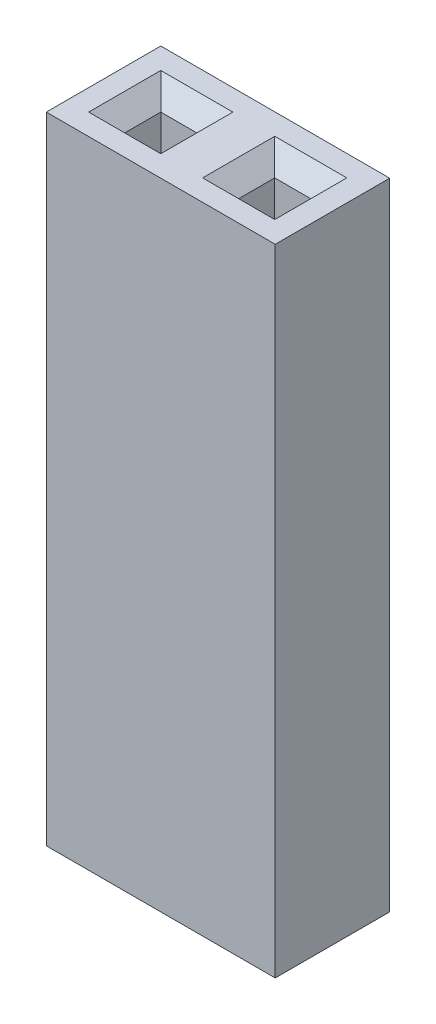
ISO-10303-21;
HEADER;
FILE_DESCRIPTION(('STEP AP214'),'2;1');
FILE_NAME('part.step','',(''),(''),'','','');
FILE_SCHEMA(('AUTOMOTIVE_DESIGN { 1 0 10303 214 1 1 1 1 }'));
ENDSEC;
DATA;
#1=APPLICATION_CONTEXT('core data for automotive mechanical design processes');
#2=APPLICATION_PROTOCOL_DEFINITION('international standard','automotive_design',2000,#1);
#3=PRODUCT_CONTEXT('',#1,'mechanical');
#4=PRODUCT('Part','Part','',(#3));
#5=PRODUCT_RELATED_PRODUCT_CATEGORY('part','',(#4));
#6=PRODUCT_DEFINITION_FORMATION('','',#4);
#7=PRODUCT_DEFINITION_CONTEXT('part definition',#1,'design');
#8=PRODUCT_DEFINITION('design','',#6,#7);
#9=PRODUCT_DEFINITION_SHAPE('','',#8);
#10=(LENGTH_UNIT() NAMED_UNIT(*) SI_UNIT(.MILLI.,.METRE.));
#11=(NAMED_UNIT(*) PLANE_ANGLE_UNIT() SI_UNIT($,.RADIAN.));
#12=(NAMED_UNIT(*) SI_UNIT($,.STERADIAN.) SOLID_ANGLE_UNIT());
#13=UNCERTAINTY_MEASURE_WITH_UNIT(LENGTH_MEASURE(1.E-05),#10,'distance_accuracy_value','');
#14=(GEOMETRIC_REPRESENTATION_CONTEXT(3) GLOBAL_UNCERTAINTY_ASSIGNED_CONTEXT((#13)) GLOBAL_UNIT_ASSIGNED_CONTEXT((#10,
#11,#12)) REPRESENTATION_CONTEXT('',''));
#15=CARTESIAN_POINT('',(0.,0.,0.));
#16=DIRECTION('',(0.,0.,1.));
#17=DIRECTION('',(1.,0.,0.));
#18=AXIS2_PLACEMENT_3D('',#15,#16,#17);
#19=CARTESIAN_POINT('',(4.19891981997239,13.7,0.));
#20=DIRECTION('',(0.707106781186546,-0.707106781186549,0.));
#21=DIRECTION('',(0.,0.,-1.));
#22=AXIS2_PLACEMENT_3D('',#19,#20,#21);
#23=PLANE('',#22);
#24=DIRECTION('',(0.577350269189627,0.577350269189624,-0.577350269189627));
#25=VECTOR('',#24,1.);
#26=CARTESIAN_POINT('',(3.06594654664826,12.5670267266759,-0.537026726675869));
#27=LINE('',#26,#25);
#28=CARTESIAN_POINT('',(4.19891981997239,13.7,-1.67));
#29=VERTEX_POINT('',#28);
#30=CARTESIAN_POINT('',(4.5989198199724,14.1,-2.07000000000001));
#31=VERTEX_POINT('',#30);
#32=EDGE_CURVE('E273',#29,#31,#27,.T.);
#33=ORIENTED_EDGE('',*,*,#32,.F.);
#34=DIRECTION('',(-0.707106781186549,-0.707106781186546,0.));
#35=VECTOR('',#34,1.);
#36=CARTESIAN_POINT('',(4.19891981997239,13.7,-1.67));
#37=LINE('',#36,#35);
#38=CARTESIAN_POINT('',(4.21,13.7110801800276,-1.67));
#39=VERTEX_POINT('',#38);
#40=EDGE_CURVE('E179',#29,#39,#37,.F.);
#41=ORIENTED_EDGE('',*,*,#40,.T.);
#42=DIRECTION('',(0.,0.,1.));
#43=VECTOR('',#42,1.);
#44=CARTESIAN_POINT('',(4.21,13.7110801800276,0.));
#45=LINE('',#44,#43);
#46=CARTESIAN_POINT('',(4.21,13.7110801800276,-0.87));
#47=VERTEX_POINT('',#46);
#48=EDGE_CURVE('E11',#47,#39,#45,.F.);
#49=ORIENTED_EDGE('',*,*,#48,.F.);
#50=DIRECTION('',(-0.707106781186549,-0.707106781186546,0.));
#51=VECTOR('',#50,1.);
#52=CARTESIAN_POINT('',(4.19891981997239,13.7,-0.87));
#53=LINE('',#52,#51);
#54=CARTESIAN_POINT('',(4.19891981997239,13.7,-0.87));
#55=VERTEX_POINT('',#54);
#56=EDGE_CURVE('E43',#55,#47,#53,.F.);
#57=ORIENTED_EDGE('',*,*,#56,.F.);
#58=DIRECTION('',(-0.577350269189627,-0.577350269189624,-0.577350269189627));
#59=VECTOR('',#58,1.);
#60=CARTESIAN_POINT('',(4.48891981997239,13.99,-0.579999999999999));
#61=LINE('',#60,#59);
#62=CARTESIAN_POINT('',(4.5989198199724,14.1,-0.469999999999996));
#63=VERTEX_POINT('',#62);
#64=EDGE_CURVE('E279',#55,#63,#61,.F.);
#65=ORIENTED_EDGE('',*,*,#64,.T.);
#66=DIRECTION('',(0.,0.,1.));
#67=VECTOR('',#66,1.);
#68=CARTESIAN_POINT('',(4.5989198199724,14.1,0.));
#69=LINE('',#68,#67);
#70=EDGE_CURVE('E255',#31,#63,#69,.T.);
#71=ORIENTED_EDGE('',*,*,#70,.F.);
#72=EDGE_LOOP('',(#33,#41,#49,#57,#65,#71));
#73=FACE_BOUND('',#72,.T.);
#74=ADVANCED_FACE('F34',(#73),#23,.F.);
#75=CARTESIAN_POINT('',(0.,14.1,0.));
#76=DIRECTION('',(1.,0.,0.));
#77=DIRECTION('',(0.,0.,-1.));
#78=AXIS2_PLACEMENT_3D('',#75,#76,#77);
#79=PLANE('',#78);
#80=DIRECTION('',(0.,0.,1.));
#81=VECTOR('',#80,1.);
#82=CARTESIAN_POINT('',(0.,0.,0.));
#83=LINE('',#82,#81);
#84=CARTESIAN_POINT('',(0.,0.,-2.54));
#85=VERTEX_POINT('',#84);
#86=CARTESIAN_POINT('',(0.,0.,0.));
#87=VERTEX_POINT('',#86);
#88=EDGE_CURVE('E200',#85,#87,#83,.T.);
#89=ORIENTED_EDGE('',*,*,#88,.T.);
#90=DIRECTION('',(0.,-1.,0.));
#91=VECTOR('',#90,1.);
#92=CARTESIAN_POINT('',(0.,14.1,0.));
#93=LINE('',#92,#91);
#94=CARTESIAN_POINT('',(0.,14.1,0.));
#95=VERTEX_POINT('',#94);
#96=EDGE_CURVE('E239',#95,#87,#93,.T.);
#97=ORIENTED_EDGE('',*,*,#96,.F.);
#98=DIRECTION('',(0.,0.,1.));
#99=VECTOR('',#98,1.);
#100=CARTESIAN_POINT('',(0.,14.1,0.));
#101=LINE('',#100,#99);
#102=CARTESIAN_POINT('',(0.,14.1,-2.54));
#103=VERTEX_POINT('',#102);
#104=EDGE_CURVE('E213',#103,#95,#101,.T.);
#105=ORIENTED_EDGE('',*,*,#104,.F.);
#106=DIRECTION('',(0.,-1.,0.));
#107=VECTOR('',#106,1.);
#108=CARTESIAN_POINT('',(0.,14.1,-2.54));
#109=LINE('',#108,#107);
#110=EDGE_CURVE('E223',#103,#85,#109,.T.);
#111=ORIENTED_EDGE('',*,*,#110,.T.);
#112=EDGE_LOOP('',(#89,#97,#105,#111));
#113=FACE_BOUND('',#112,.T.);
#114=ADVANCED_FACE('F329',(#113),#79,.F.);
#115=CARTESIAN_POINT('',(0.,14.1,0.));
#116=DIRECTION('',(0.,0.,-1.));
#117=DIRECTION('',(-1.,0.,0.));
#118=AXIS2_PLACEMENT_3D('',#115,#116,#117);
#119=PLANE('',#118);
#120=DIRECTION('',(1.,0.,0.));
#121=VECTOR('',#120,1.);
#122=CARTESIAN_POINT('',(0.,0.,0.));
#123=LINE('',#122,#121);
#124=CARTESIAN_POINT('',(5.08,0.,0.));
#125=VERTEX_POINT('',#124);
#126=EDGE_CURVE('E226',#87,#125,#123,.T.);
#127=ORIENTED_EDGE('',*,*,#126,.T.);
#128=DIRECTION('',(0.,-1.,0.));
#129=VECTOR('',#128,1.);
#130=CARTESIAN_POINT('',(5.08,14.1,0.));
#131=LINE('',#130,#129);
#132=CARTESIAN_POINT('',(5.08,14.1,0.));
#133=VERTEX_POINT('',#132);
#134=EDGE_CURVE('E236',#133,#125,#131,.T.);
#135=ORIENTED_EDGE('',*,*,#134,.F.);
#136=DIRECTION('',(1.,0.,0.));
#137=VECTOR('',#136,1.);
#138=CARTESIAN_POINT('',(0.,14.1,0.));
#139=LINE('',#138,#137);
#140=EDGE_CURVE('E216',#95,#133,#139,.T.);
#141=ORIENTED_EDGE('',*,*,#140,.F.);
#142=ORIENTED_EDGE('',*,*,#96,.T.);
#143=EDGE_LOOP('',(#127,#135,#141,#142));
#144=FACE_BOUND('',#143,.T.);
#145=ADVANCED_FACE('F332',(#144),#119,.F.);
#146=CARTESIAN_POINT('',(5.08,14.1,0.));
#147=DIRECTION('',(-1.,0.,0.));
#148=DIRECTION('',(0.,0.,1.));
#149=AXIS2_PLACEMENT_3D('',#146,#147,#148);
#150=PLANE('',#149);
#151=DIRECTION('',(0.,0.,-1.));
#152=VECTOR('',#151,1.);
#153=CARTESIAN_POINT('',(5.08,0.,0.));
#154=LINE('',#153,#152);
#155=CARTESIAN_POINT('',(5.08,0.,-2.54));
#156=VERTEX_POINT('',#155);
#157=EDGE_CURVE('E228',#125,#156,#154,.T.);
#158=ORIENTED_EDGE('',*,*,#157,.T.);
#159=DIRECTION('',(0.,-1.,0.));
#160=VECTOR('',#159,1.);
#161=CARTESIAN_POINT('',(5.08,14.1,-2.54));
#162=LINE('',#161,#160);
#163=CARTESIAN_POINT('',(5.08,14.1,-2.54));
#164=VERTEX_POINT('',#163);
#165=EDGE_CURVE('E233',#164,#156,#162,.T.);
#166=ORIENTED_EDGE('',*,*,#165,.F.);
#167=DIRECTION('',(0.,0.,-1.));
#168=VECTOR('',#167,1.);
#169=CARTESIAN_POINT('',(5.08,14.1,0.));
#170=LINE('',#169,#168);
#171=EDGE_CURVE('E219',#133,#164,#170,.T.);
#172=ORIENTED_EDGE('',*,*,#171,.F.);
#173=ORIENTED_EDGE('',*,*,#134,.T.);
#174=EDGE_LOOP('',(#158,#166,#172,#173));
#175=FACE_BOUND('',#174,.T.);
#176=ADVANCED_FACE('F337',(#175),#150,.F.);
#177=CARTESIAN_POINT('',(0.,14.1,-2.54));
#178=DIRECTION('',(0.,0.,1.));
#179=DIRECTION('',(1.,0.,0.));
#180=AXIS2_PLACEMENT_3D('',#177,#178,#179);
#181=PLANE('',#180);
#182=DIRECTION('',(-1.,0.,0.));
#183=VECTOR('',#182,1.);
#184=CARTESIAN_POINT('',(0.,0.,-2.54));
#185=LINE('',#184,#183);
#186=EDGE_CURVE('E217',#156,#85,#185,.T.);
#187=ORIENTED_EDGE('',*,*,#186,.T.);
#188=ORIENTED_EDGE('',*,*,#110,.F.);
#189=DIRECTION('',(-1.,0.,0.));
#190=VECTOR('',#189,1.);
#191=CARTESIAN_POINT('',(0.,14.1,-2.54));
#192=LINE('',#191,#190);
#193=EDGE_CURVE('E221',#164,#103,#192,.T.);
#194=ORIENTED_EDGE('',*,*,#193,.F.);
#195=ORIENTED_EDGE('',*,*,#165,.T.);
#196=EDGE_LOOP('',(#187,#188,#194,#195));
#197=FACE_BOUND('',#196,.T.);
#198=ADVANCED_FACE('F320',(#197),#181,.F.);
#199=CARTESIAN_POINT('',(0.,14.1,0.));
#200=DIRECTION('',(0.,-1.,0.));
#201=DIRECTION('',(0.,0.,-1.));
#202=AXIS2_PLACEMENT_3D('',#199,#200,#201);
#203=PLANE('',#202);
#204=DIRECTION('',(0.,0.,-1.));
#205=VECTOR('',#204,1.);
#206=CARTESIAN_POINT('',(2.99891981997239,14.1,-1.67));
#207=LINE('',#206,#205);
#208=CARTESIAN_POINT('',(2.99891981997239,14.1,-0.469999999999996));
#209=VERTEX_POINT('',#208);
#210=CARTESIAN_POINT('',(2.99891981997239,14.1,-2.07000000000001));
#211=VERTEX_POINT('',#210);
#212=EDGE_CURVE('E251',#209,#211,#207,.T.);
#213=ORIENTED_EDGE('',*,*,#212,.T.);
#214=DIRECTION('',(1.,0.,0.));
#215=VECTOR('',#214,1.);
#216=CARTESIAN_POINT('',(4.19891981997239,14.1,-2.07000000000001));
#217=LINE('',#216,#215);
#218=EDGE_CURVE('E257',#211,#31,#217,.T.);
#219=ORIENTED_EDGE('',*,*,#218,.T.);
#220=ORIENTED_EDGE('',*,*,#70,.T.);
#221=DIRECTION('',(-1.,0.,0.));
#222=VECTOR('',#221,1.);
#223=CARTESIAN_POINT('',(0.,14.1,-0.469999999999996));
#224=LINE('',#223,#222);
#225=EDGE_CURVE('E253',#63,#209,#224,.T.);
#226=ORIENTED_EDGE('',*,*,#225,.T.);
#227=EDGE_LOOP('',(#213,#219,#220,#226));
#228=FACE_BOUND('',#227,.T.);
#229=DIRECTION('',(-1.,0.,0.));
#230=VECTOR('',#229,1.);
#231=CARTESIAN_POINT('',(0.,14.1,-0.470000000000002));
#232=LINE('',#231,#230);
#233=CARTESIAN_POINT('',(2.07,14.1,-0.470000000000002));
#234=VERTEX_POINT('',#233);
#235=CARTESIAN_POINT('',(0.470000000000002,14.1,-0.470000000000002));
#236=VERTEX_POINT('',#235);
#237=EDGE_CURVE('E242',#234,#236,#232,.T.);
#238=ORIENTED_EDGE('',*,*,#237,.T.);
#239=DIRECTION('',(0.,0.,-1.));
#240=VECTOR('',#239,1.);
#241=CARTESIAN_POINT('',(0.470000000000002,14.1,-1.67));
#242=LINE('',#241,#240);
#243=CARTESIAN_POINT('',(0.470000000000002,14.1,-2.07));
#244=VERTEX_POINT('',#243);
#245=EDGE_CURVE('E248',#236,#244,#242,.T.);
#246=ORIENTED_EDGE('',*,*,#245,.T.);
#247=DIRECTION('',(1.,0.,0.));
#248=VECTOR('',#247,1.);
#249=CARTESIAN_POINT('',(1.67,14.1,-2.07));
#250=LINE('',#249,#248);
#251=CARTESIAN_POINT('',(2.07,14.1,-2.07));
#252=VERTEX_POINT('',#251);
#253=EDGE_CURVE('E246',#244,#252,#250,.T.);
#254=ORIENTED_EDGE('',*,*,#253,.T.);
#255=DIRECTION('',(0.,0.,1.));
#256=VECTOR('',#255,1.);
#257=CARTESIAN_POINT('',(2.07,14.1,0.));
#258=LINE('',#257,#256);
#259=EDGE_CURVE('E244',#252,#234,#258,.T.);
#260=ORIENTED_EDGE('',*,*,#259,.T.);
#261=EDGE_LOOP('',(#238,#246,#254,#260));
#262=FACE_BOUND('',#261,.T.);
#263=ORIENTED_EDGE('',*,*,#104,.T.);
#264=ORIENTED_EDGE('',*,*,#140,.T.);
#265=ORIENTED_EDGE('',*,*,#171,.T.);
#266=ORIENTED_EDGE('',*,*,#193,.T.);
#267=EDGE_LOOP('',(#263,#264,#265,#266));
#268=FACE_BOUND('',#267,.T.);
#269=ADVANCED_FACE('F316',(#228,#262,#268),#203,.F.);
#270=CARTESIAN_POINT('',(0.,0.,0.));
#271=DIRECTION('',(0.,-1.,0.));
#272=DIRECTION('',(0.,0.,-1.));
#273=AXIS2_PLACEMENT_3D('',#270,#271,#272);
#274=PLANE('',#273);
#275=ORIENTED_EDGE('',*,*,#88,.F.);
#276=ORIENTED_EDGE('',*,*,#186,.F.);
#277=ORIENTED_EDGE('',*,*,#157,.F.);
#278=ORIENTED_EDGE('',*,*,#126,.F.);
#279=EDGE_LOOP('',(#275,#276,#277,#278));
#280=FACE_BOUND('',#279,.T.);
#281=ADVANCED_FACE('F319',(#280),#274,.T.);
#282=CARTESIAN_POINT('',(0.,4.1,-0.87));
#283=DIRECTION('',(0.,0.,1.));
#284=DIRECTION('',(1.,0.,0.));
#285=AXIS2_PLACEMENT_3D('',#282,#283,#284);
#286=PLANE('',#285);
#287=DIRECTION('',(0.,1.,0.));
#288=VECTOR('',#287,1.);
#289=CARTESIAN_POINT('',(4.21,4.1,-0.87));
#290=LINE('',#289,#288);
#291=CARTESIAN_POINT('',(4.21,4.1,-0.87));
#292=VERTEX_POINT('',#291);
#293=EDGE_CURVE('E169',#292,#47,#290,.T.);
#294=ORIENTED_EDGE('',*,*,#293,.F.);
#295=DIRECTION('',(1.,0.,0.));
#296=VECTOR('',#295,1.);
#297=CARTESIAN_POINT('',(0.,4.1,-0.87));
#298=LINE('',#297,#296);
#299=CARTESIAN_POINT('',(3.39891981997239,4.1,-0.87));
#300=VERTEX_POINT('',#299);
#301=EDGE_CURVE('E156',#300,#292,#298,.T.);
#302=ORIENTED_EDGE('',*,*,#301,.F.);
#303=DIRECTION('',(0.,1.,0.));
#304=VECTOR('',#303,1.);
#305=CARTESIAN_POINT('',(3.39891981997239,4.1,-0.87));
#306=LINE('',#305,#304);
#307=CARTESIAN_POINT('',(3.39891981997239,13.7,-0.87));
#308=VERTEX_POINT('',#307);
#309=EDGE_CURVE('E190',#300,#308,#306,.T.);
#310=ORIENTED_EDGE('',*,*,#309,.T.);
#311=DIRECTION('',(1.,0.,0.));
#312=VECTOR('',#311,1.);
#313=CARTESIAN_POINT('',(0.,13.7,-0.87));
#314=LINE('',#313,#312);
#315=EDGE_CURVE('E262',#308,#55,#314,.T.);
#316=ORIENTED_EDGE('',*,*,#315,.T.);
#317=ORIENTED_EDGE('',*,*,#56,.T.);
#318=EDGE_LOOP('',(#294,#302,#310,#316,#317));
#319=FACE_BOUND('',#318,.T.);
#320=ADVANCED_FACE('F170',(#319),#286,.F.);
#321=CARTESIAN_POINT('',(3.39891981997239,4.1,0.));
#322=DIRECTION('',(1.,0.,0.));
#323=DIRECTION('',(0.,0.,-1.));
#324=AXIS2_PLACEMENT_3D('',#321,#322,#323);
#325=PLANE('',#324);
#326=DIRECTION('',(0.,1.,0.));
#327=VECTOR('',#326,1.);
#328=CARTESIAN_POINT('',(3.39891981997239,4.1,-1.67));
#329=LINE('',#328,#327);
#330=CARTESIAN_POINT('',(3.39891981997239,4.1,-1.67));
#331=VERTEX_POINT('',#330);
#332=CARTESIAN_POINT('',(3.39891981997239,13.7,-1.67));
#333=VERTEX_POINT('',#332);
#334=EDGE_CURVE('E209',#331,#333,#329,.T.);
#335=ORIENTED_EDGE('',*,*,#334,.T.);
#336=DIRECTION('',(0.,0.,1.));
#337=VECTOR('',#336,1.);
#338=CARTESIAN_POINT('',(3.39891981997239,13.7,-0.87));
#339=LINE('',#338,#337);
#340=EDGE_CURVE('E264',#333,#308,#339,.T.);
#341=ORIENTED_EDGE('',*,*,#340,.T.);
#342=ORIENTED_EDGE('',*,*,#309,.F.);
#343=DIRECTION('',(0.,0.,-1.));
#344=VECTOR('',#343,1.);
#345=CARTESIAN_POINT('',(3.39891981997239,4.1,0.));
#346=LINE('',#345,#344);
#347=EDGE_CURVE('E162',#300,#331,#346,.T.);
#348=ORIENTED_EDGE('',*,*,#347,.T.);
#349=EDGE_LOOP('',(#335,#341,#342,#348));
#350=FACE_BOUND('',#349,.T.);
#351=ADVANCED_FACE('F346',(#350),#325,.T.);
#352=CARTESIAN_POINT('',(0.,4.1,-1.67));
#353=DIRECTION('',(0.,0.,1.));
#354=DIRECTION('',(1.,0.,0.));
#355=AXIS2_PLACEMENT_3D('',#352,#353,#354);
#356=PLANE('',#355);
#357=DIRECTION('',(-1.,0.,0.));
#358=VECTOR('',#357,1.);
#359=CARTESIAN_POINT('',(3.39891981997239,13.7,-1.67));
#360=LINE('',#359,#358);
#361=EDGE_CURVE('E260',#29,#333,#360,.T.);
#362=ORIENTED_EDGE('',*,*,#361,.T.);
#363=ORIENTED_EDGE('',*,*,#334,.F.);
#364=DIRECTION('',(1.,0.,0.));
#365=VECTOR('',#364,1.);
#366=CARTESIAN_POINT('',(0.,4.1,-1.67));
#367=LINE('',#366,#365);
#368=CARTESIAN_POINT('',(4.21,4.1,-1.67));
#369=VERTEX_POINT('',#368);
#370=EDGE_CURVE('E165',#331,#369,#367,.T.);
#371=ORIENTED_EDGE('',*,*,#370,.T.);
#372=DIRECTION('',(0.,1.,0.));
#373=VECTOR('',#372,1.);
#374=CARTESIAN_POINT('',(4.21,4.1,-1.67));
#375=LINE('',#374,#373);
#376=EDGE_CURVE('E174',#369,#39,#375,.T.);
#377=ORIENTED_EDGE('',*,*,#376,.T.);
#378=ORIENTED_EDGE('',*,*,#40,.F.);
#379=EDGE_LOOP('',(#362,#363,#371,#377,#378));
#380=FACE_BOUND('',#379,.T.);
#381=ADVANCED_FACE('F410',(#380),#356,.T.);
#382=CARTESIAN_POINT('',(0.,4.1,0.));
#383=DIRECTION('',(0.,1.,0.));
#384=DIRECTION('',(0.,0.,1.));
#385=AXIS2_PLACEMENT_3D('',#382,#383,#384);
#386=PLANE('',#385);
#387=DIRECTION('',(0.,0.,-1.));
#388=VECTOR('',#387,1.);
#389=CARTESIAN_POINT('',(4.21,4.1,-0.87));
#390=LINE('',#389,#388);
#391=EDGE_CURVE('E161',#292,#369,#390,.T.);
#392=ORIENTED_EDGE('',*,*,#391,.T.);
#393=ORIENTED_EDGE('',*,*,#370,.F.);
#394=ORIENTED_EDGE('',*,*,#347,.F.);
#395=ORIENTED_EDGE('',*,*,#301,.T.);
#396=EDGE_LOOP('',(#392,#393,#394,#395));
#397=FACE_BOUND('',#396,.T.);
#398=ADVANCED_FACE('F158',(#397),#386,.T.);
#399=CARTESIAN_POINT('',(0.,4.1,-0.87));
#400=DIRECTION('',(0.,0.,1.));
#401=DIRECTION('',(1.,0.,0.));
#402=AXIS2_PLACEMENT_3D('',#399,#400,#401);
#403=PLANE('',#402);
#404=DIRECTION('',(0.,1.,0.));
#405=VECTOR('',#404,1.);
#406=CARTESIAN_POINT('',(0.87,4.1,-0.87));
#407=LINE('',#406,#405);
#408=CARTESIAN_POINT('',(0.87,4.1,-0.87));
#409=VERTEX_POINT('',#408);
#410=CARTESIAN_POINT('',(0.87,13.7,-0.87));
#411=VERTEX_POINT('',#410);
#412=EDGE_CURVE('E198',#409,#411,#407,.T.);
#413=ORIENTED_EDGE('',*,*,#412,.T.);
#414=DIRECTION('',(1.,0.,0.));
#415=VECTOR('',#414,1.);
#416=CARTESIAN_POINT('',(0.,13.7,-0.87));
#417=LINE('',#416,#415);
#418=CARTESIAN_POINT('',(1.67,13.7,-0.87));
#419=VERTEX_POINT('',#418);
#420=EDGE_CURVE('E50',#411,#419,#417,.T.);
#421=ORIENTED_EDGE('',*,*,#420,.T.);
#422=DIRECTION('',(0.,1.,0.));
#423=VECTOR('',#422,1.);
#424=CARTESIAN_POINT('',(1.67,4.1,-0.87));
#425=LINE('',#424,#423);
#426=CARTESIAN_POINT('',(1.67,4.1,-0.87));
#427=VERTEX_POINT('',#426);
#428=EDGE_CURVE('E197',#427,#419,#425,.T.);
#429=ORIENTED_EDGE('',*,*,#428,.F.);
#430=DIRECTION('',(1.,0.,0.));
#431=VECTOR('',#430,1.);
#432=CARTESIAN_POINT('',(0.,4.1,-0.87));
#433=LINE('',#432,#431);
#434=EDGE_CURVE('E186',#409,#427,#433,.T.);
#435=ORIENTED_EDGE('',*,*,#434,.F.);
#436=EDGE_LOOP('',(#413,#421,#429,#435));
#437=FACE_BOUND('',#436,.T.);
#438=ADVANCED_FACE('F421',(#437),#403,.F.);
#439=CARTESIAN_POINT('',(0.87,4.1,0.));
#440=DIRECTION('',(1.,0.,0.));
#441=DIRECTION('',(0.,0.,-1.));
#442=AXIS2_PLACEMENT_3D('',#439,#440,#441);
#443=PLANE('',#442);
#444=DIRECTION('',(0.,1.,0.));
#445=VECTOR('',#444,1.);
#446=CARTESIAN_POINT('',(0.87,4.1,-1.67));
#447=LINE('',#446,#445);
#448=CARTESIAN_POINT('',(0.87,4.1,-1.67));
#449=VERTEX_POINT('',#448);
#450=CARTESIAN_POINT('',(0.87,13.7,-1.67));
#451=VERTEX_POINT('',#450);
#452=EDGE_CURVE('E201',#449,#451,#447,.T.);
#453=ORIENTED_EDGE('',*,*,#452,.T.);
#454=DIRECTION('',(0.,0.,1.));
#455=VECTOR('',#454,1.);
#456=CARTESIAN_POINT('',(0.87,13.7,-0.87));
#457=LINE('',#456,#455);
#458=EDGE_CURVE('E266',#451,#411,#457,.T.);
#459=ORIENTED_EDGE('',*,*,#458,.T.);
#460=ORIENTED_EDGE('',*,*,#412,.F.);
#461=DIRECTION('',(0.,0.,-1.));
#462=VECTOR('',#461,1.);
#463=CARTESIAN_POINT('',(0.87,4.1,0.));
#464=LINE('',#463,#462);
#465=EDGE_CURVE('E195',#409,#449,#464,.T.);
#466=ORIENTED_EDGE('',*,*,#465,.T.);
#467=EDGE_LOOP('',(#453,#459,#460,#466));
#468=FACE_BOUND('',#467,.T.);
#469=ADVANCED_FACE('F310',(#468),#443,.T.);
#470=CARTESIAN_POINT('',(0.,4.1,-1.67));
#471=DIRECTION('',(0.,0.,1.));
#472=DIRECTION('',(1.,0.,0.));
#473=AXIS2_PLACEMENT_3D('',#470,#471,#472);
#474=PLANE('',#473);
#475=DIRECTION('',(0.,1.,0.));
#476=VECTOR('',#475,1.);
#477=CARTESIAN_POINT('',(1.67,4.1,-1.67));
#478=LINE('',#477,#476);
#479=CARTESIAN_POINT('',(1.67,4.1,-1.67));
#480=VERTEX_POINT('',#479);
#481=CARTESIAN_POINT('',(1.67,13.7,-1.67));
#482=VERTEX_POINT('',#481);
#483=EDGE_CURVE('E204',#480,#482,#478,.T.);
#484=ORIENTED_EDGE('',*,*,#483,.T.);
#485=DIRECTION('',(-1.,0.,0.));
#486=VECTOR('',#485,1.);
#487=CARTESIAN_POINT('',(0.87,13.7,-1.67));
#488=LINE('',#487,#486);
#489=EDGE_CURVE('E269',#482,#451,#488,.T.);
#490=ORIENTED_EDGE('',*,*,#489,.T.);
#491=ORIENTED_EDGE('',*,*,#452,.F.);
#492=DIRECTION('',(1.,0.,0.));
#493=VECTOR('',#492,1.);
#494=CARTESIAN_POINT('',(0.,4.1,-1.67));
#495=LINE('',#494,#493);
#496=EDGE_CURVE('E193',#449,#480,#495,.T.);
#497=ORIENTED_EDGE('',*,*,#496,.T.);
#498=EDGE_LOOP('',(#484,#490,#491,#497));
#499=FACE_BOUND('',#498,.T.);
#500=ADVANCED_FACE('F306',(#499),#474,.T.);
#501=CARTESIAN_POINT('',(1.67,4.1,0.));
#502=DIRECTION('',(1.,0.,0.));
#503=DIRECTION('',(0.,0.,-1.));
#504=AXIS2_PLACEMENT_3D('',#501,#502,#503);
#505=PLANE('',#504);
#506=ORIENTED_EDGE('',*,*,#428,.T.);
#507=DIRECTION('',(0.,0.,-1.));
#508=VECTOR('',#507,1.);
#509=CARTESIAN_POINT('',(1.67,13.7,0.));
#510=LINE('',#509,#508);
#511=EDGE_CURVE('E57',#419,#482,#510,.T.);
#512=ORIENTED_EDGE('',*,*,#511,.T.);
#513=ORIENTED_EDGE('',*,*,#483,.F.);
#514=DIRECTION('',(0.,0.,-1.));
#515=VECTOR('',#514,1.);
#516=CARTESIAN_POINT('',(1.67,4.1,0.));
#517=LINE('',#516,#515);
#518=EDGE_CURVE('E189',#427,#480,#517,.T.);
#519=ORIENTED_EDGE('',*,*,#518,.F.);
#520=EDGE_LOOP('',(#506,#512,#513,#519));
#521=FACE_BOUND('',#520,.T.);
#522=ADVANCED_FACE('F427',(#521),#505,.F.);
#523=CARTESIAN_POINT('',(0.,4.1,0.));
#524=DIRECTION('',(0.,1.,0.));
#525=DIRECTION('',(0.,0.,1.));
#526=AXIS2_PLACEMENT_3D('',#523,#524,#525);
#527=PLANE('',#526);
#528=ORIENTED_EDGE('',*,*,#434,.T.);
#529=ORIENTED_EDGE('',*,*,#518,.T.);
#530=ORIENTED_EDGE('',*,*,#496,.F.);
#531=ORIENTED_EDGE('',*,*,#465,.F.);
#532=EDGE_LOOP('',(#528,#529,#530,#531));
#533=FACE_BOUND('',#532,.T.);
#534=ADVANCED_FACE('F377',(#533),#527,.T.);
#535=CARTESIAN_POINT('',(0.,13.7,-0.87));
#536=DIRECTION('',(0.,-0.707106781186549,0.707106781186546));
#537=DIRECTION('',(1.,0.,0.));
#538=AXIS2_PLACEMENT_3D('',#535,#536,#537);
#539=PLANE('',#538);
#540=ORIENTED_EDGE('',*,*,#64,.F.);
#541=ORIENTED_EDGE('',*,*,#315,.F.);
#542=DIRECTION('',(-0.577350269189627,0.577350269189624,0.577350269189627));
#543=VECTOR('',#542,1.);
#544=CARTESIAN_POINT('',(2.26594654664826,14.8329732733241,0.262973273324134));
#545=LINE('',#544,#543);
#546=EDGE_CURVE('E166',#209,#308,#545,.F.);
#547=ORIENTED_EDGE('',*,*,#546,.F.);
#548=ORIENTED_EDGE('',*,*,#225,.F.);
#549=EDGE_LOOP('',(#540,#541,#547,#548));
#550=FACE_BOUND('',#549,.T.);
#551=ADVANCED_FACE('F371',(#550),#539,.F.);
#552=CARTESIAN_POINT('',(2.99891981997239,14.1,0.));
#553=DIRECTION('',(0.707106781186546,0.707106781186549,0.));
#554=DIRECTION('',(0.,0.,1.));
#555=AXIS2_PLACEMENT_3D('',#552,#553,#554);
#556=PLANE('',#555);
#557=ORIENTED_EDGE('',*,*,#546,.T.);
#558=ORIENTED_EDGE('',*,*,#340,.F.);
#559=DIRECTION('',(-0.577350269189627,0.577350269189624,-0.577350269189627));
#560=VECTOR('',#559,1.);
#561=CARTESIAN_POINT('',(1.99927987998159,15.0996399399908,-3.0696399399908));
#562=LINE('',#561,#560);
#563=EDGE_CURVE('E275',#211,#333,#562,.F.);
#564=ORIENTED_EDGE('',*,*,#563,.F.);
#565=ORIENTED_EDGE('',*,*,#212,.F.);
#566=EDGE_LOOP('',(#557,#558,#564,#565));
#567=FACE_BOUND('',#566,.T.);
#568=ADVANCED_FACE('F365',(#567),#556,.T.);
#569=CARTESIAN_POINT('',(0.,14.1,-2.07000000000001));
#570=DIRECTION('',(0.,0.707106781186549,0.707106781186546));
#571=DIRECTION('',(-1.,0.,0.));
#572=AXIS2_PLACEMENT_3D('',#569,#570,#571);
#573=PLANE('',#572);
#574=ORIENTED_EDGE('',*,*,#563,.T.);
#575=ORIENTED_EDGE('',*,*,#361,.F.);
#576=ORIENTED_EDGE('',*,*,#32,.T.);
#577=ORIENTED_EDGE('',*,*,#218,.F.);
#578=EDGE_LOOP('',(#574,#575,#576,#577));
#579=FACE_BOUND('',#578,.T.);
#580=ADVANCED_FACE('F364',(#579),#573,.T.);
#581=CARTESIAN_POINT('',(1.67,13.7,0.));
#582=DIRECTION('',(0.707106781186548,-0.707106781186548,0.));
#583=DIRECTION('',(0.,0.,-1.));
#584=AXIS2_PLACEMENT_3D('',#581,#582,#583);
#585=PLANE('',#584);
#586=DIRECTION('',(0.577350269189626,0.577350269189626,-0.577350269189626));
#587=VECTOR('',#586,1.);
#588=CARTESIAN_POINT('',(1.38,13.41,-1.38));
#589=LINE('',#588,#587);
#590=EDGE_CURVE('E287',#482,#252,#589,.T.);
#591=ORIENTED_EDGE('',*,*,#590,.F.);
#592=ORIENTED_EDGE('',*,*,#511,.F.);
#593=DIRECTION('',(-0.577350269189626,-0.577350269189626,-0.577350269189626));
#594=VECTOR('',#593,1.);
#595=CARTESIAN_POINT('',(1.96,13.99,-0.58));
#596=LINE('',#595,#594);
#597=EDGE_CURVE('E276',#234,#419,#596,.T.);
#598=ORIENTED_EDGE('',*,*,#597,.F.);
#599=ORIENTED_EDGE('',*,*,#259,.F.);
#600=EDGE_LOOP('',(#591,#592,#598,#599));
#601=FACE_BOUND('',#600,.T.);
#602=ADVANCED_FACE('F37',(#601),#585,.F.);
#603=CARTESIAN_POINT('',(0.,13.7,-0.87));
#604=DIRECTION('',(0.,-0.707106781186548,0.707106781186548));
#605=DIRECTION('',(1.,0.,0.));
#606=AXIS2_PLACEMENT_3D('',#603,#604,#605);
#607=PLANE('',#606);
#608=ORIENTED_EDGE('',*,*,#597,.T.);
#609=ORIENTED_EDGE('',*,*,#420,.F.);
#610=DIRECTION('',(0.577350269189626,-0.577350269189626,-0.577350269189626));
#611=VECTOR('',#610,1.);
#612=CARTESIAN_POINT('',(0.313333333333335,14.2566666666667,-0.313333333333335));
#613=LINE('',#612,#611);
#614=EDGE_CURVE('E285',#236,#411,#613,.T.);
#615=ORIENTED_EDGE('',*,*,#614,.F.);
#616=ORIENTED_EDGE('',*,*,#237,.F.);
#617=EDGE_LOOP('',(#608,#609,#615,#616));
#618=FACE_BOUND('',#617,.T.);
#619=ADVANCED_FACE('F294',(#618),#607,.F.);
#620=CARTESIAN_POINT('',(0.,14.1,-2.07));
#621=DIRECTION('',(0.,0.707106781186548,0.707106781186548));
#622=DIRECTION('',(-1.,0.,0.));
#623=AXIS2_PLACEMENT_3D('',#620,#621,#622);
#624=PLANE('',#623);
#625=ORIENTED_EDGE('',*,*,#590,.T.);
#626=ORIENTED_EDGE('',*,*,#253,.F.);
#627=DIRECTION('',(0.577350269189626,-0.577350269189626,0.577350269189626));
#628=VECTOR('',#627,1.);
#629=CARTESIAN_POINT('',(1.16,13.41,-1.38));
#630=LINE('',#629,#628);
#631=EDGE_CURVE('E182',#451,#244,#630,.F.);
#632=ORIENTED_EDGE('',*,*,#631,.F.);
#633=ORIENTED_EDGE('',*,*,#489,.F.);
#634=EDGE_LOOP('',(#625,#626,#632,#633));
#635=FACE_BOUND('',#634,.T.);
#636=ADVANCED_FACE('F303',(#635),#624,.T.);
#637=CARTESIAN_POINT('',(0.470000000000002,14.1,0.));
#638=DIRECTION('',(0.707106781186548,0.707106781186548,0.));
#639=DIRECTION('',(0.,0.,1.));
#640=AXIS2_PLACEMENT_3D('',#637,#638,#639);
#641=PLANE('',#640);
#642=ORIENTED_EDGE('',*,*,#614,.T.);
#643=ORIENTED_EDGE('',*,*,#458,.F.);
#644=ORIENTED_EDGE('',*,*,#631,.T.);
#645=ORIENTED_EDGE('',*,*,#245,.F.);
#646=EDGE_LOOP('',(#642,#643,#644,#645));
#647=FACE_BOUND('',#646,.T.);
#648=ADVANCED_FACE('F313',(#647),#641,.T.);
#649=CARTESIAN_POINT('',(4.21,4.1,-0.87));
#650=DIRECTION('',(1.,0.,0.));
#651=DIRECTION('',(0.,0.,-1.));
#652=AXIS2_PLACEMENT_3D('',#649,#650,#651);
#653=PLANE('',#652);
#654=ORIENTED_EDGE('',*,*,#48,.T.);
#655=ORIENTED_EDGE('',*,*,#376,.F.);
#656=ORIENTED_EDGE('',*,*,#391,.F.);
#657=ORIENTED_EDGE('',*,*,#293,.T.);
#658=EDGE_LOOP('',(#654,#655,#656,#657));
#659=FACE_BOUND('',#658,.T.);
#660=ADVANCED_FACE('F177',(#659),#653,.F.);
#661=CLOSED_SHELL('',(#74,#114,#145,#176,#198,#269,#281,#320,#351,#381,#398,#438,#469,#500,#522,
#534,#551,#568,#580,#602,#619,#636,#648,#660));
#662=MANIFOLD_SOLID_BREP('B2',#661);
#663=ADVANCED_BREP_SHAPE_REPRESENTATION('',(#18,#662),#14);
#664=SHAPE_DEFINITION_REPRESENTATION(#9,#663);
ENDSEC;
END-ISO-10303-21;
